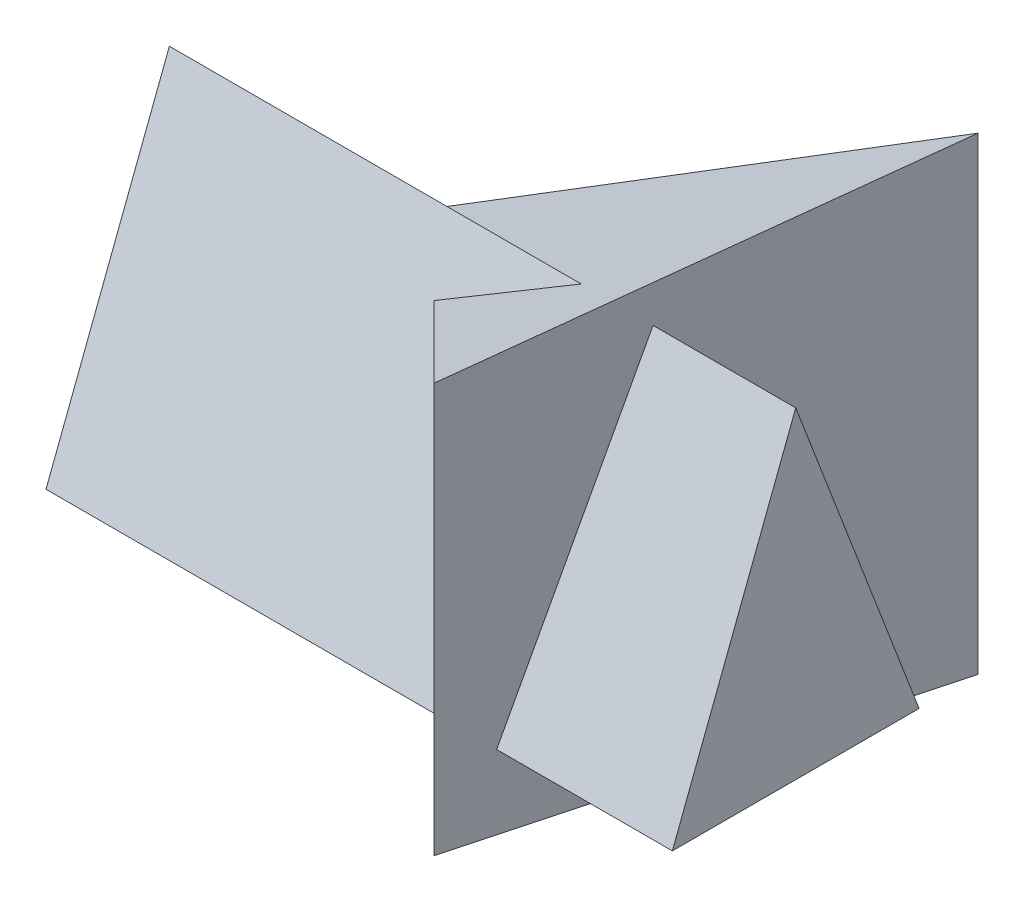
ISO-10303-21;
HEADER;
FILE_DESCRIPTION(('STEP AP214'),'2;1');
FILE_NAME('part.step','',(''),(''),'','','');
FILE_SCHEMA(('AUTOMOTIVE_DESIGN { 1 0 10303 214 1 1 1 1 }'));
ENDSEC;
DATA;
#1=APPLICATION_CONTEXT('core data for automotive mechanical design processes');
#2=APPLICATION_PROTOCOL_DEFINITION('international standard','automotive_design',2000,#1);
#3=PRODUCT_CONTEXT('',#1,'mechanical');
#4=PRODUCT('Part','Part','',(#3));
#5=PRODUCT_RELATED_PRODUCT_CATEGORY('part','',(#4));
#6=PRODUCT_DEFINITION_FORMATION('','',#4);
#7=PRODUCT_DEFINITION_CONTEXT('part definition',#1,'design');
#8=PRODUCT_DEFINITION('design','',#6,#7);
#9=PRODUCT_DEFINITION_SHAPE('','',#8);
#10=(LENGTH_UNIT() NAMED_UNIT(*) SI_UNIT(.MILLI.,.METRE.));
#11=(NAMED_UNIT(*) PLANE_ANGLE_UNIT() SI_UNIT($,.RADIAN.));
#12=(NAMED_UNIT(*) SI_UNIT($,.STERADIAN.) SOLID_ANGLE_UNIT());
#13=UNCERTAINTY_MEASURE_WITH_UNIT(LENGTH_MEASURE(1.E-05),#10,'distance_accuracy_value','');
#14=(GEOMETRIC_REPRESENTATION_CONTEXT(3) GLOBAL_UNCERTAINTY_ASSIGNED_CONTEXT((#13)) GLOBAL_UNIT_ASSIGNED_CONTEXT((#10,
#11,#12)) REPRESENTATION_CONTEXT('',''));
#15=CARTESIAN_POINT('',(0.,0.,0.));
#16=DIRECTION('',(0.,0.,1.));
#17=DIRECTION('',(1.,0.,0.));
#18=AXIS2_PLACEMENT_3D('',#15,#16,#17);
#19=CARTESIAN_POINT('',(101.93,15.,53.6396103067889));
#20=DIRECTION('',(0.,-0.357746176739147,-0.933818865213443));
#21=DIRECTION('',(0.,0.933818865213443,-0.357746176739147));
#22=AXIS2_PLACEMENT_3D('',#19,#20,#21);
#23=PLANE('',#22);
#24=DIRECTION('',(-1.,0.,0.));
#25=VECTOR('',#24,1.);
#26=CARTESIAN_POINT('',(101.93,80.2570821109251,28.6396103067889));
#27=LINE('',#26,#25);
#28=CARTESIAN_POINT('',(101.93,80.2570821109251,28.6396103067889));
#29=VERTEX_POINT('',#28);
#30=CARTESIAN_POINT('',(-25.,80.2570821109251,28.6396103067889));
#31=VERTEX_POINT('',#30);
#32=EDGE_CURVE('E88',#29,#31,#27,.T.);
#33=ORIENTED_EDGE('',*,*,#32,.T.);
#34=DIRECTION('',(0.,-0.933818865213443,0.357746176739147));
#35=VECTOR('',#34,1.);
#36=CARTESIAN_POINT('',(-25.,15.,53.6396103067889));
#37=LINE('',#36,#35);
#38=CARTESIAN_POINT('',(-25.,15.,53.6396103067889));
#39=VERTEX_POINT('',#38);
#40=EDGE_CURVE('E84',#31,#39,#37,.T.);
#41=ORIENTED_EDGE('',*,*,#40,.T.);
#42=DIRECTION('',(-1.,0.,0.));
#43=VECTOR('',#42,1.);
#44=CARTESIAN_POINT('',(101.93,15.,53.6396103067889));
#45=LINE('',#44,#43);
#46=CARTESIAN_POINT('',(101.93,15.,53.6396103067889));
#47=VERTEX_POINT('',#46);
#48=EDGE_CURVE('E12',#47,#39,#45,.T.);
#49=ORIENTED_EDGE('',*,*,#48,.F.);
#50=DIRECTION('',(0.,-0.933818865213443,0.357746176739147));
#51=VECTOR('',#50,1.);
#52=CARTESIAN_POINT('',(101.93,15.,53.6396103067889));
#53=LINE('',#52,#51);
#54=EDGE_CURVE('E92',#29,#47,#53,.T.);
#55=ORIENTED_EDGE('',*,*,#54,.F.);
#56=EDGE_LOOP('',(#33,#41,#49,#55));
#57=FACE_BOUND('',#56,.T.);
#58=ADVANCED_FACE('F42',(#57),#23,.F.);
#59=CARTESIAN_POINT('',(101.93,15.,3.63961030678894));
#60=DIRECTION('',(0.,1.,0.));
#61=DIRECTION('',(0.,0.,1.));
#62=AXIS2_PLACEMENT_3D('',#59,#60,#61);
#63=PLANE('',#62);
#64=ORIENTED_EDGE('',*,*,#48,.T.);
#65=DIRECTION('',(0.,0.,-1.));
#66=VECTOR('',#65,1.);
#67=CARTESIAN_POINT('',(-25.,15.,3.63961030678894));
#68=LINE('',#67,#66);
#69=CARTESIAN_POINT('',(-25.,15.,3.63961030678894));
#70=VERTEX_POINT('',#69);
#71=EDGE_CURVE('E76',#39,#70,#68,.T.);
#72=ORIENTED_EDGE('',*,*,#71,.T.);
#73=DIRECTION('',(-1.,0.,0.));
#74=VECTOR('',#73,1.);
#75=CARTESIAN_POINT('',(101.93,15.,3.63961030678894));
#76=LINE('',#75,#74);
#77=CARTESIAN_POINT('',(101.93,15.,3.63961030678894));
#78=VERTEX_POINT('',#77);
#79=EDGE_CURVE('E49',#78,#70,#76,.T.);
#80=ORIENTED_EDGE('',*,*,#79,.F.);
#81=DIRECTION('',(0.,0.,-1.));
#82=VECTOR('',#81,1.);
#83=CARTESIAN_POINT('',(101.93,15.,3.63961030678894));
#84=LINE('',#83,#82);
#85=EDGE_CURVE('E60',#47,#78,#84,.T.);
#86=ORIENTED_EDGE('',*,*,#85,.F.);
#87=EDGE_LOOP('',(#64,#72,#80,#86));
#88=FACE_BOUND('',#87,.T.);
#89=ADVANCED_FACE('F75',(#88),#63,.F.);
#90=CARTESIAN_POINT('',(101.93,80.2570821109251,28.6396103067889));
#91=DIRECTION('',(0.,-0.357746176739148,0.933818865213443));
#92=DIRECTION('',(0.,-0.933818865213443,-0.357746176739148));
#93=AXIS2_PLACEMENT_3D('',#90,#91,#92);
#94=PLANE('',#93);
#95=ORIENTED_EDGE('',*,*,#79,.T.);
#96=DIRECTION('',(0.,0.933818865213443,0.357746176739148));
#97=VECTOR('',#96,1.);
#98=CARTESIAN_POINT('',(-25.,80.2570821109251,28.6396103067889));
#99=LINE('',#98,#97);
#100=EDGE_CURVE('E86',#70,#31,#99,.T.);
#101=ORIENTED_EDGE('',*,*,#100,.T.);
#102=ORIENTED_EDGE('',*,*,#32,.F.);
#103=DIRECTION('',(0.,0.933818865213443,0.357746176739148));
#104=VECTOR('',#103,1.);
#105=CARTESIAN_POINT('',(101.93,80.2570821109251,28.6396103067889));
#106=LINE('',#105,#104);
#107=EDGE_CURVE('E56',#78,#29,#106,.T.);
#108=ORIENTED_EDGE('',*,*,#107,.F.);
#109=EDGE_LOOP('',(#95,#101,#102,#108));
#110=FACE_BOUND('',#109,.T.);
#111=ADVANCED_FACE('F97',(#110),#94,.F.);
#112=CARTESIAN_POINT('',(101.93,15.,53.6396103067889));
#113=DIRECTION('',(1.,0.,0.));
#114=DIRECTION('',(0.,0.,-1.));
#115=AXIS2_PLACEMENT_3D('',#112,#113,#114);
#116=PLANE('',#115);
#117=ORIENTED_EDGE('',*,*,#54,.T.);
#118=ORIENTED_EDGE('',*,*,#85,.T.);
#119=ORIENTED_EDGE('',*,*,#107,.T.);
#120=EDGE_LOOP('',(#117,#118,#119));
#121=FACE_BOUND('',#120,.T.);
#122=ADVANCED_FACE('F98',(#121),#116,.T.);
#123=CARTESIAN_POINT('',(-25.,15.,53.6396103067889));
#124=DIRECTION('',(1.,0.,0.));
#125=DIRECTION('',(0.,0.,-1.));
#126=AXIS2_PLACEMENT_3D('',#123,#124,#125);
#127=PLANE('',#126);
#128=ORIENTED_EDGE('',*,*,#40,.F.);
#129=ORIENTED_EDGE('',*,*,#100,.F.);
#130=ORIENTED_EDGE('',*,*,#71,.F.);
#131=EDGE_LOOP('',(#128,#129,#130));
#132=FACE_BOUND('',#131,.T.);
#133=ADVANCED_FACE('F83',(#132),#127,.F.);
#134=CLOSED_SHELL('',(#58,#89,#111,#122,#133));
#135=MANIFOLD_SOLID_BREP('B2',#134);
#136=CARTESIAN_POINT('',(63.6396103067896,95.,63.6396103067889));
#137=DIRECTION('',(0.707106781186544,0.,-0.707106781186551));
#138=DIRECTION('',(-0.707106781186551,0.,-0.707106781186544));
#139=AXIS2_PLACEMENT_3D('',#136,#137,#138);
#140=PLANE('',#139);
#141=DIRECTION('',(0.,-1.,0.));
#142=VECTOR('',#141,1.);
#143=CARTESIAN_POINT('',(63.6396103067896,95.,63.6396103067889));
#144=LINE('',#143,#142);
#145=CARTESIAN_POINT('',(63.6396103067896,82.9422863405997,63.6396103067889));
#146=VERTEX_POINT('',#145);
#147=CARTESIAN_POINT('',(63.6396103067896,0.,63.6396103067889));
#148=VERTEX_POINT('',#147);
#149=EDGE_CURVE('E40',#146,#148,#144,.T.);
#150=ORIENTED_EDGE('',*,*,#149,.F.);
#151=DIRECTION('',(-0.664023331817196,-0.343723769333442,-0.664023331817189));
#152=VECTOR('',#151,1.);
#153=CARTESIAN_POINT('',(66.3916701376365,84.3668573355693,66.3916701376358));
#154=LINE('',#153,#152);
#155=CARTESIAN_POINT('',(0.,50.,0.));
#156=VERTEX_POINT('',#155);
#157=EDGE_CURVE('E173',#146,#156,#154,.T.);
#158=ORIENTED_EDGE('',*,*,#157,.T.);
#159=DIRECTION('',(0.,-1.,0.));
#160=VECTOR('',#159,1.);
#161=CARTESIAN_POINT('',(0.,95.,0.));
#162=LINE('',#161,#160);
#163=CARTESIAN_POINT('',(0.,0.,0.));
#164=VERTEX_POINT('',#163);
#165=EDGE_CURVE('E161',#156,#164,#162,.T.);
#166=ORIENTED_EDGE('',*,*,#165,.T.);
#167=DIRECTION('',(0.707106781186551,0.,0.707106781186544));
#168=VECTOR('',#167,1.);
#169=CARTESIAN_POINT('',(63.6396103067896,0.,63.6396103067889));
#170=LINE('',#169,#168);
#171=EDGE_CURVE('E179',#164,#148,#170,.T.);
#172=ORIENTED_EDGE('',*,*,#171,.T.);
#173=EDGE_LOOP('',(#150,#158,#166,#172));
#174=FACE_BOUND('',#173,.T.);
#175=ADVANCED_FACE('F139',(#174),#140,.F.);
#176=CARTESIAN_POINT('',(86.933324366016,95.,-23.2937140592274));
#177=DIRECTION('',(-0.96592582628907,0.,-0.258819045102516));
#178=DIRECTION('',(-0.258819045102516,0.,0.96592582628907));
#179=AXIS2_PLACEMENT_3D('',#176,#177,#178);
#180=PLANE('',#179);
#181=DIRECTION('',(0.,-1.,0.));
#182=VECTOR('',#181,1.);
#183=CARTESIAN_POINT('',(86.933324366016,95.,-23.2937140592274));
#184=LINE('',#183,#182);
#185=CARTESIAN_POINT('',(86.933324366016,95.,-23.2937140592274));
#186=VERTEX_POINT('',#185);
#187=CARTESIAN_POINT('',(86.933324366016,0.,-23.2937140592274));
#188=VERTEX_POINT('',#187);
#189=EDGE_CURVE('E146',#186,#188,#184,.T.);
#190=ORIENTED_EDGE('',*,*,#189,.F.);
#191=DIRECTION('',(-0.256527057434098,-0.132788176096106,0.957372011860213));
#192=VECTOR('',#191,1.);
#193=CARTESIAN_POINT('',(86.933324366016,95.,-23.2937140592274));
#194=LINE('',#193,#192);
#195=EDGE_CURVE('E153',#186,#146,#194,.T.);
#196=ORIENTED_EDGE('',*,*,#195,.T.);
#197=ORIENTED_EDGE('',*,*,#149,.T.);
#198=DIRECTION('',(0.258819045102516,0.,-0.96592582628907));
#199=VECTOR('',#198,1.);
#200=CARTESIAN_POINT('',(86.933324366016,0.,-23.2937140592274));
#201=LINE('',#200,#199);
#202=EDGE_CURVE('E186',#148,#188,#201,.T.);
#203=ORIENTED_EDGE('',*,*,#202,.T.);
#204=EDGE_LOOP('',(#190,#196,#197,#203));
#205=FACE_BOUND('',#204,.T.);
#206=ADVANCED_FACE('F192',(#205),#180,.F.);
#207=CARTESIAN_POINT('',(0.,95.,0.));
#208=DIRECTION('',(0.258819045102526,0.,0.965925826289067));
#209=DIRECTION('',(0.965925826289067,0.,-0.258819045102526));
#210=AXIS2_PLACEMENT_3D('',#207,#208,#209);
#211=PLANE('',#210);
#212=ORIENTED_EDGE('',*,*,#165,.F.);
#213=DIRECTION('',(0.863950323522003,0.447213595499958,-0.231494791488333));
#214=VECTOR('',#213,1.);
#215=CARTESIAN_POINT('',(17.3866648732032,59.,-4.65874281184547));
#216=LINE('',#215,#214);
#217=EDGE_CURVE('E171',#156,#186,#216,.T.);
#218=ORIENTED_EDGE('',*,*,#217,.T.);
#219=ORIENTED_EDGE('',*,*,#189,.T.);
#220=DIRECTION('',(-0.965925826289067,0.,0.258819045102526));
#221=VECTOR('',#220,1.);
#222=CARTESIAN_POINT('',(0.,0.,0.));
#223=LINE('',#222,#221);
#224=EDGE_CURVE('E183',#188,#164,#223,.T.);
#225=ORIENTED_EDGE('',*,*,#224,.T.);
#226=EDGE_LOOP('',(#212,#218,#219,#225));
#227=FACE_BOUND('',#226,.T.);
#228=ADVANCED_FACE('F181',(#227),#211,.F.);
#229=CARTESIAN_POINT('',(0.,0.,0.));
#230=DIRECTION('',(0.,-1.,0.));
#231=DIRECTION('',(0.,0.,-1.));
#232=AXIS2_PLACEMENT_3D('',#229,#230,#231);
#233=PLANE('',#232);
#234=ORIENTED_EDGE('',*,*,#171,.F.);
#235=ORIENTED_EDGE('',*,*,#224,.F.);
#236=ORIENTED_EDGE('',*,*,#202,.F.);
#237=EDGE_LOOP('',(#234,#235,#236));
#238=FACE_BOUND('',#237,.T.);
#239=ADVANCED_FACE('F195',(#238),#233,.T.);
#240=CARTESIAN_POINT('',(86.933324366016,95.,-67.5));
#241=DIRECTION('',(0.459700843380983,-0.888073833977115,0.));
#242=DIRECTION('',(0.888073833977115,0.459700843380984,0.));
#243=AXIS2_PLACEMENT_3D('',#240,#241,#242);
#244=PLANE('',#243);
#245=ORIENTED_EDGE('',*,*,#195,.F.);
#246=ORIENTED_EDGE('',*,*,#217,.F.);
#247=ORIENTED_EDGE('',*,*,#157,.F.);
#248=EDGE_LOOP('',(#245,#246,#247));
#249=FACE_BOUND('',#248,.T.);
#250=ADVANCED_FACE('F172',(#249),#244,.F.);
#251=CLOSED_SHELL('',(#175,#206,#228,#239,#250));
#252=MANIFOLD_SOLID_BREP('B6',#251);
#253=ADVANCED_BREP_SHAPE_REPRESENTATION('',(#18,#135,#252),#14);
#254=SHAPE_DEFINITION_REPRESENTATION(#9,#253);
ENDSEC;
END-ISO-10303-21;
